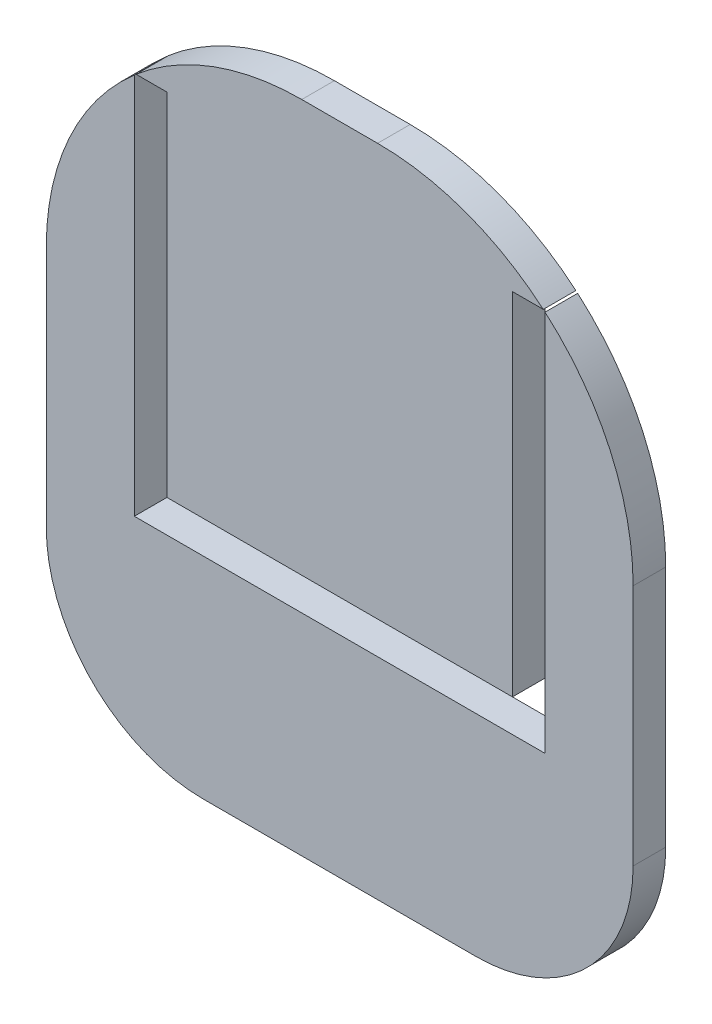
ISO-10303-21;
HEADER;
FILE_DESCRIPTION(('STEP AP214'),'2;1');
FILE_NAME('part.step','',(''),(''),'','','');
FILE_SCHEMA(('AUTOMOTIVE_DESIGN { 1 0 10303 214 1 1 1 1 }'));
ENDSEC;
DATA;
#1=APPLICATION_CONTEXT('core data for automotive mechanical design processes');
#2=APPLICATION_PROTOCOL_DEFINITION('international standard','automotive_design',2000,#1);
#3=PRODUCT_CONTEXT('',#1,'mechanical');
#4=PRODUCT('Part','Part','',(#3));
#5=PRODUCT_RELATED_PRODUCT_CATEGORY('part','',(#4));
#6=PRODUCT_DEFINITION_FORMATION('','',#4);
#7=PRODUCT_DEFINITION_CONTEXT('part definition',#1,'design');
#8=PRODUCT_DEFINITION('design','',#6,#7);
#9=PRODUCT_DEFINITION_SHAPE('','',#8);
#10=(LENGTH_UNIT() NAMED_UNIT(*) SI_UNIT(.MILLI.,.METRE.));
#11=(NAMED_UNIT(*) PLANE_ANGLE_UNIT() SI_UNIT($,.RADIAN.));
#12=(NAMED_UNIT(*) SI_UNIT($,.STERADIAN.) SOLID_ANGLE_UNIT());
#13=UNCERTAINTY_MEASURE_WITH_UNIT(LENGTH_MEASURE(1.E-05),#10,'distance_accuracy_value','');
#14=(GEOMETRIC_REPRESENTATION_CONTEXT(3) GLOBAL_UNCERTAINTY_ASSIGNED_CONTEXT((#13)) GLOBAL_UNIT_ASSIGNED_CONTEXT((#10,
#11,#12)) REPRESENTATION_CONTEXT('',''));
#15=CARTESIAN_POINT('',(0.,0.,0.));
#16=DIRECTION('',(0.,0.,1.));
#17=DIRECTION('',(1.,0.,0.));
#18=AXIS2_PLACEMENT_3D('',#15,#16,#17);
#19=CARTESIAN_POINT('',(5.,-29.5,4.3));
#20=DIRECTION('',(0.,0.,-1.));
#21=DIRECTION('',(-1.,0.,0.));
#22=AXIS2_PLACEMENT_3D('',#19,#20,#21);
#23=CYLINDRICAL_SURFACE('',#22,33.7);
#24=CARTESIAN_POINT('',(5.,-29.5,4.3));
#25=DIRECTION('',(0.,0.,1.));
#26=DIRECTION('',(-1.,0.,0.));
#27=AXIS2_PLACEMENT_3D('',#24,#25,#26);
#28=CIRCLE('',#27,33.7);
#29=CARTESIAN_POINT('',(26.85235312187,-3.84527990725494,4.3));
#30=VERTEX_POINT('',#29);
#31=CARTESIAN_POINT('',(5.,4.2,4.3));
#32=VERTEX_POINT('',#31);
#33=EDGE_CURVE('E142',#30,#32,#28,.T.);
#34=ORIENTED_EDGE('',*,*,#33,.F.);
#35=DIRECTION('',(0.,0.,-1.));
#36=VECTOR('',#35,1.);
#37=CARTESIAN_POINT('',(26.85235312187,-3.84527990725494,4.3));
#38=LINE('',#37,#36);
#39=CARTESIAN_POINT('',(26.85235312187,-3.84527990725494,0.));
#40=VERTEX_POINT('',#39);
#41=EDGE_CURVE('E65',#30,#40,#38,.T.);
#42=ORIENTED_EDGE('',*,*,#41,.T.);
#43=CARTESIAN_POINT('',(5.,-29.5,0.));
#44=DIRECTION('',(0.,0.,1.));
#45=DIRECTION('',(-1.,0.,0.));
#46=AXIS2_PLACEMENT_3D('',#43,#44,#45);
#47=CIRCLE('',#46,33.7);
#48=CARTESIAN_POINT('',(5.,4.2,0.));
#49=VERTEX_POINT('',#48);
#50=EDGE_CURVE('E51',#40,#49,#47,.T.);
#51=ORIENTED_EDGE('',*,*,#50,.T.);
#52=DIRECTION('',(0.,0.,-1.));
#53=VECTOR('',#52,1.);
#54=CARTESIAN_POINT('',(5.,4.2,4.3));
#55=LINE('',#54,#53);
#56=EDGE_CURVE('E146',#32,#49,#55,.T.);
#57=ORIENTED_EDGE('',*,*,#56,.F.);
#58=EDGE_LOOP('',(#34,#42,#51,#57));
#59=FACE_BOUND('',#58,.T.);
#60=ADVANCED_FACE('F48',(#59),#23,.T.);
#61=CARTESIAN_POINT('',(-18.,-61.5,4.3));
#62=DIRECTION('',(0.,0.,1.));
#63=DIRECTION('',(1.,0.,0.));
#64=AXIS2_PLACEMENT_3D('',#61,#62,#63);
#65=PLANE('',#64);
#66=DIRECTION('',(-1.,0.,0.));
#67=VECTOR('',#66,1.);
#68=CARTESIAN_POINT('',(-27.085,-3.84527990725494,4.3));
#69=LINE('',#68,#67);
#70=CARTESIAN_POINT('',(-22.785,-3.84527990725494,4.3));
#71=VERTEX_POINT('',#70);
#72=CARTESIAN_POINT('',(-26.85235312187,-3.84527990725494,4.3));
#73=VERTEX_POINT('',#72);
#74=EDGE_CURVE('E174',#71,#73,#69,.T.);
#75=ORIENTED_EDGE('',*,*,#74,.F.);
#76=DIRECTION('',(0.,1.,0.));
#77=VECTOR('',#76,1.);
#78=CARTESIAN_POINT('',(-22.785,-3.84527990725494,4.3));
#79=LINE('',#78,#77);
#80=CARTESIAN_POINT('',(-22.785,-50.1452799072549,4.3));
#81=VERTEX_POINT('',#80);
#82=EDGE_CURVE('E171',#81,#71,#79,.T.);
#83=ORIENTED_EDGE('',*,*,#82,.F.);
#84=DIRECTION('',(-1.,0.,0.));
#85=VECTOR('',#84,1.);
#86=CARTESIAN_POINT('',(-22.785,-50.1452799072549,4.3));
#87=LINE('',#86,#85);
#88=CARTESIAN_POINT('',(22.785,-50.1452799072549,4.3));
#89=VERTEX_POINT('',#88);
#90=EDGE_CURVE('E126',#89,#81,#87,.T.);
#91=ORIENTED_EDGE('',*,*,#90,.F.);
#92=DIRECTION('',(0.,-1.,0.));
#93=VECTOR('',#92,1.);
#94=CARTESIAN_POINT('',(22.785,-50.1452799072549,4.3));
#95=LINE('',#94,#93);
#96=CARTESIAN_POINT('',(22.785,-3.84527990725494,4.3));
#97=VERTEX_POINT('',#96);
#98=EDGE_CURVE('E57',#97,#89,#95,.T.);
#99=ORIENTED_EDGE('',*,*,#98,.F.);
#100=DIRECTION('',(-1.,0.,0.));
#101=VECTOR('',#100,1.);
#102=CARTESIAN_POINT('',(22.785,-3.84527990725494,4.3));
#103=LINE('',#102,#101);
#104=EDGE_CURVE('E12',#30,#97,#103,.T.);
#105=ORIENTED_EDGE('',*,*,#104,.F.);
#106=ORIENTED_EDGE('',*,*,#33,.T.);
#107=DIRECTION('',(-1.,0.,0.));
#108=VECTOR('',#107,1.);
#109=CARTESIAN_POINT('',(-4.99999999999999,4.2,4.3));
#110=LINE('',#109,#108);
#111=CARTESIAN_POINT('',(-4.99999999999999,4.2,4.3));
#112=VERTEX_POINT('',#111);
#113=EDGE_CURVE('E141',#32,#112,#110,.T.);
#114=ORIENTED_EDGE('',*,*,#113,.T.);
#115=CARTESIAN_POINT('',(-4.99999999999999,-29.5,4.3));
#116=DIRECTION('',(0.,0.,1.));
#117=DIRECTION('',(-1.,0.,0.));
#118=AXIS2_PLACEMENT_3D('',#115,#116,#117);
#119=CIRCLE('',#118,33.7);
#120=EDGE_CURVE('E138',#112,#73,#119,.T.);
#121=ORIENTED_EDGE('',*,*,#120,.T.);
#122=EDGE_LOOP('',(#75,#83,#91,#99,#105,#106,#114,#121));
#123=FACE_BOUND('',#122,.T.);
#124=ADVANCED_FACE('F132',(#123),#65,.T.);
#125=CARTESIAN_POINT('',(-18.,-61.5,0.));
#126=DIRECTION('',(0.,0.,1.));
#127=DIRECTION('',(1.,0.,0.));
#128=AXIS2_PLACEMENT_3D('',#125,#126,#127);
#129=PLANE('',#128);
#130=DIRECTION('',(0.,1.,0.));
#131=VECTOR('',#130,1.);
#132=CARTESIAN_POINT('',(-22.785,-61.5,0.));
#133=LINE('',#132,#131);
#134=CARTESIAN_POINT('',(-22.785,-50.1452799072549,0.));
#135=VERTEX_POINT('',#134);
#136=CARTESIAN_POINT('',(-22.785,-3.84527990725494,0.));
#137=VERTEX_POINT('',#136);
#138=EDGE_CURVE('E94',#135,#137,#133,.T.);
#139=ORIENTED_EDGE('',*,*,#138,.T.);
#140=DIRECTION('',(-1.,0.,0.));
#141=VECTOR('',#140,1.);
#142=CARTESIAN_POINT('',(-18.,-3.84527990725494,0.));
#143=LINE('',#142,#141);
#144=CARTESIAN_POINT('',(-26.85235312187,-3.84527990725494,0.));
#145=VERTEX_POINT('',#144);
#146=EDGE_CURVE('E187',#137,#145,#143,.T.);
#147=ORIENTED_EDGE('',*,*,#146,.T.);
#148=CARTESIAN_POINT('',(-4.99999999999999,-29.5,0.));
#149=DIRECTION('',(0.,0.,1.));
#150=DIRECTION('',(-1.,0.,0.));
#151=AXIS2_PLACEMENT_3D('',#148,#149,#150);
#152=CIRCLE('',#151,33.7);
#153=CARTESIAN_POINT('',(-4.99999999999999,4.2,0.));
#154=VERTEX_POINT('',#153);
#155=EDGE_CURVE('E143',#154,#145,#152,.T.);
#156=ORIENTED_EDGE('',*,*,#155,.F.);
#157=DIRECTION('',(-1.,0.,0.));
#158=VECTOR('',#157,1.);
#159=CARTESIAN_POINT('',(-4.99999999999999,4.2,0.));
#160=LINE('',#159,#158);
#161=EDGE_CURVE('E154',#49,#154,#160,.T.);
#162=ORIENTED_EDGE('',*,*,#161,.F.);
#163=ORIENTED_EDGE('',*,*,#50,.F.);
#164=DIRECTION('',(-1.,0.,0.));
#165=VECTOR('',#164,1.);
#166=CARTESIAN_POINT('',(-18.,-3.84527990725494,0.));
#167=LINE('',#166,#165);
#168=CARTESIAN_POINT('',(22.785,-3.84527990725494,0.));
#169=VERTEX_POINT('',#168);
#170=EDGE_CURVE('E164',#40,#169,#167,.T.);
#171=ORIENTED_EDGE('',*,*,#170,.T.);
#172=DIRECTION('',(0.,-1.,0.));
#173=VECTOR('',#172,1.);
#174=CARTESIAN_POINT('',(22.785,-61.5,0.));
#175=LINE('',#174,#173);
#176=CARTESIAN_POINT('',(22.785,-50.1452799072549,0.));
#177=VERTEX_POINT('',#176);
#178=EDGE_CURVE('E124',#169,#177,#175,.T.);
#179=ORIENTED_EDGE('',*,*,#178,.T.);
#180=DIRECTION('',(-1.,0.,0.));
#181=VECTOR('',#180,1.);
#182=CARTESIAN_POINT('',(-18.,-50.1452799072549,0.));
#183=LINE('',#182,#181);
#184=EDGE_CURVE('E160',#177,#135,#183,.T.);
#185=ORIENTED_EDGE('',*,*,#184,.T.);
#186=EDGE_LOOP('',(#139,#147,#156,#162,#163,#171,#179,#185));
#187=FACE_BOUND('',#186,.T.);
#188=ADVANCED_FACE('F185',(#187),#129,.F.);
#189=CARTESIAN_POINT('',(-4.99999999999999,4.2,4.3));
#190=DIRECTION('',(0.,-1.,0.));
#191=DIRECTION('',(1.,0.,0.));
#192=AXIS2_PLACEMENT_3D('',#189,#190,#191);
#193=PLANE('',#192);
#194=ORIENTED_EDGE('',*,*,#161,.T.);
#195=DIRECTION('',(0.,0.,-1.));
#196=VECTOR('',#195,1.);
#197=CARTESIAN_POINT('',(-4.99999999999999,4.2,4.3));
#198=LINE('',#197,#196);
#199=EDGE_CURVE('E151',#112,#154,#198,.T.);
#200=ORIENTED_EDGE('',*,*,#199,.F.);
#201=ORIENTED_EDGE('',*,*,#113,.F.);
#202=ORIENTED_EDGE('',*,*,#56,.T.);
#203=EDGE_LOOP('',(#194,#200,#201,#202));
#204=FACE_BOUND('',#203,.T.);
#205=ADVANCED_FACE('F193',(#204),#193,.F.);
#206=CARTESIAN_POINT('',(-4.99999999999999,-29.5,4.3));
#207=DIRECTION('',(0.,0.,-1.));
#208=DIRECTION('',(-1.,0.,0.));
#209=AXIS2_PLACEMENT_3D('',#206,#207,#208);
#210=CYLINDRICAL_SURFACE('',#209,33.7);
#211=ORIENTED_EDGE('',*,*,#155,.T.);
#212=DIRECTION('',(0.,0.,-1.));
#213=VECTOR('',#212,1.);
#214=CARTESIAN_POINT('',(-26.85235312187,-3.84527990725494,4.3));
#215=LINE('',#214,#213);
#216=EDGE_CURVE('E145',#145,#73,#215,.F.);
#217=ORIENTED_EDGE('',*,*,#216,.T.);
#218=ORIENTED_EDGE('',*,*,#120,.F.);
#219=ORIENTED_EDGE('',*,*,#199,.T.);
#220=EDGE_LOOP('',(#211,#217,#218,#219));
#221=FACE_BOUND('',#220,.T.);
#222=ADVANCED_FACE('F182',(#221),#210,.T.);
#223=CARTESIAN_POINT('',(-27.085,-3.84527990725494,-5.7));
#224=DIRECTION('',(0.,1.,0.));
#225=DIRECTION('',(0.,0.,1.));
#226=AXIS2_PLACEMENT_3D('',#223,#224,#225);
#227=PLANE('',#226);
#228=ORIENTED_EDGE('',*,*,#146,.F.);
#229=DIRECTION('',(0.,0.,1.));
#230=VECTOR('',#229,1.);
#231=CARTESIAN_POINT('',(-22.785,-3.84527990725494,-5.7));
#232=LINE('',#231,#230);
#233=EDGE_CURVE('E166',#137,#71,#232,.T.);
#234=ORIENTED_EDGE('',*,*,#233,.T.);
#235=ORIENTED_EDGE('',*,*,#74,.T.);
#236=ORIENTED_EDGE('',*,*,#216,.F.);
#237=EDGE_LOOP('',(#228,#234,#235,#236));
#238=FACE_BOUND('',#237,.T.);
#239=ADVANCED_FACE('F180',(#238),#227,.F.);
#240=CARTESIAN_POINT('',(-22.785,-3.84527990725494,-5.7));
#241=DIRECTION('',(1.,0.,0.));
#242=DIRECTION('',(0.,1.,0.));
#243=AXIS2_PLACEMENT_3D('',#240,#241,#242);
#244=PLANE('',#243);
#245=DIRECTION('',(0.,0.,1.));
#246=VECTOR('',#245,1.);
#247=CARTESIAN_POINT('',(-22.785,-50.1452799072549,-5.7));
#248=LINE('',#247,#246);
#249=EDGE_CURVE('E172',#135,#81,#248,.T.);
#250=ORIENTED_EDGE('',*,*,#249,.T.);
#251=ORIENTED_EDGE('',*,*,#82,.T.);
#252=ORIENTED_EDGE('',*,*,#233,.F.);
#253=ORIENTED_EDGE('',*,*,#138,.F.);
#254=EDGE_LOOP('',(#250,#251,#252,#253));
#255=FACE_BOUND('',#254,.T.);
#256=ADVANCED_FACE('F177',(#255),#244,.F.);
#257=CARTESIAN_POINT('',(-22.785,-50.1452799072549,-5.7));
#258=DIRECTION('',(0.,1.,0.));
#259=DIRECTION('',(0.,0.,1.));
#260=AXIS2_PLACEMENT_3D('',#257,#258,#259);
#261=PLANE('',#260);
#262=DIRECTION('',(0.,0.,1.));
#263=VECTOR('',#262,1.);
#264=CARTESIAN_POINT('',(22.785,-50.1452799072549,-5.7));
#265=LINE('',#264,#263);
#266=EDGE_CURVE('E87',#177,#89,#265,.T.);
#267=ORIENTED_EDGE('',*,*,#266,.T.);
#268=ORIENTED_EDGE('',*,*,#90,.T.);
#269=ORIENTED_EDGE('',*,*,#249,.F.);
#270=ORIENTED_EDGE('',*,*,#184,.F.);
#271=EDGE_LOOP('',(#267,#268,#269,#270));
#272=FACE_BOUND('',#271,.T.);
#273=ADVANCED_FACE('F214',(#272),#261,.F.);
#274=CARTESIAN_POINT('',(22.785,-50.1452799072549,-5.7));
#275=DIRECTION('',(-1.,0.,0.));
#276=DIRECTION('',(0.,-1.,0.));
#277=AXIS2_PLACEMENT_3D('',#274,#275,#276);
#278=PLANE('',#277);
#279=DIRECTION('',(0.,0.,1.));
#280=VECTOR('',#279,1.);
#281=CARTESIAN_POINT('',(22.785,-3.84527990725494,-5.7));
#282=LINE('',#281,#280);
#283=EDGE_CURVE('E117',#169,#97,#282,.T.);
#284=ORIENTED_EDGE('',*,*,#283,.T.);
#285=ORIENTED_EDGE('',*,*,#98,.T.);
#286=ORIENTED_EDGE('',*,*,#266,.F.);
#287=ORIENTED_EDGE('',*,*,#178,.F.);
#288=EDGE_LOOP('',(#284,#285,#286,#287));
#289=FACE_BOUND('',#288,.T.);
#290=ADVANCED_FACE('F120',(#289),#278,.F.);
#291=CARTESIAN_POINT('',(22.785,-3.84527990725494,-5.7));
#292=DIRECTION('',(0.,1.,0.));
#293=DIRECTION('',(0.,0.,1.));
#294=AXIS2_PLACEMENT_3D('',#291,#292,#293);
#295=PLANE('',#294);
#296=ORIENTED_EDGE('',*,*,#104,.T.);
#297=ORIENTED_EDGE('',*,*,#283,.F.);
#298=ORIENTED_EDGE('',*,*,#170,.F.);
#299=ORIENTED_EDGE('',*,*,#41,.F.);
#300=EDGE_LOOP('',(#296,#297,#298,#299));
#301=FACE_BOUND('',#300,.T.);
#302=ADVANCED_FACE('F128',(#301),#295,.F.);
#303=CLOSED_SHELL('',(#60,#124,#188,#205,#222,#239,#256,#273,#290,#302));
#304=MANIFOLD_SOLID_BREP('B2',#303);
#305=CARTESIAN_POINT('',(-38.7,-29.5,4.3));
#306=DIRECTION('',(1.,0.,0.));
#307=DIRECTION('',(0.,0.,-1.));
#308=AXIS2_PLACEMENT_3D('',#305,#306,#307);
#309=PLANE('',#308);
#310=DIRECTION('',(0.,-1.,0.));
#311=VECTOR('',#310,1.);
#312=CARTESIAN_POINT('',(-38.7,-29.5,0.));
#313=LINE('',#312,#311);
#314=CARTESIAN_POINT('',(-38.7,-29.5,0.));
#315=VERTEX_POINT('',#314);
#316=CARTESIAN_POINT('',(-38.7,-61.5,0.));
#317=VERTEX_POINT('',#316);
#318=EDGE_CURVE('E326',#315,#317,#313,.T.);
#319=ORIENTED_EDGE('',*,*,#318,.T.);
#320=DIRECTION('',(0.,0.,-1.));
#321=VECTOR('',#320,1.);
#322=CARTESIAN_POINT('',(-38.7,-61.5,4.3));
#323=LINE('',#322,#321);
#324=CARTESIAN_POINT('',(-38.7,-61.5,4.3));
#325=VERTEX_POINT('',#324);
#326=EDGE_CURVE('E380',#325,#317,#323,.T.);
#327=ORIENTED_EDGE('',*,*,#326,.F.);
#328=DIRECTION('',(0.,-1.,0.));
#329=VECTOR('',#328,1.);
#330=CARTESIAN_POINT('',(-38.7,-29.5,4.3));
#331=LINE('',#330,#329);
#332=CARTESIAN_POINT('',(-38.7,-29.5,4.3));
#333=VERTEX_POINT('',#332);
#334=EDGE_CURVE('E299',#333,#325,#331,.T.);
#335=ORIENTED_EDGE('',*,*,#334,.F.);
#336=DIRECTION('',(0.,0.,-1.));
#337=VECTOR('',#336,1.);
#338=CARTESIAN_POINT('',(-38.7,-29.5,4.3));
#339=LINE('',#338,#337);
#340=EDGE_CURVE('E368',#333,#315,#339,.T.);
#341=ORIENTED_EDGE('',*,*,#340,.T.);
#342=EDGE_LOOP('',(#319,#327,#335,#341));
#343=FACE_BOUND('',#342,.T.);
#344=ADVANCED_FACE('F275',(#343),#309,.F.);
#345=CARTESIAN_POINT('',(-18.,-61.5,4.3));
#346=DIRECTION('',(0.,0.,-1.));
#347=DIRECTION('',(-1.,0.,0.));
#348=AXIS2_PLACEMENT_3D('',#345,#346,#347);
#349=CYLINDRICAL_SURFACE('',#348,20.7);
#350=CARTESIAN_POINT('',(-18.,-61.5,0.));
#351=DIRECTION('',(0.,0.,1.));
#352=DIRECTION('',(1.,0.,0.));
#353=AXIS2_PLACEMENT_3D('',#350,#351,#352);
#354=CIRCLE('',#353,20.7);
#355=CARTESIAN_POINT('',(-18.,-82.2,0.));
#356=VERTEX_POINT('',#355);
#357=EDGE_CURVE('E381',#317,#356,#354,.T.);
#358=ORIENTED_EDGE('',*,*,#357,.T.);
#359=DIRECTION('',(0.,0.,-1.));
#360=VECTOR('',#359,1.);
#361=CARTESIAN_POINT('',(-18.,-82.2,4.3));
#362=LINE('',#361,#360);
#363=CARTESIAN_POINT('',(-18.,-82.2,4.3));
#364=VERTEX_POINT('',#363);
#365=EDGE_CURVE('E402',#364,#356,#362,.T.);
#366=ORIENTED_EDGE('',*,*,#365,.F.);
#367=CARTESIAN_POINT('',(-18.,-61.5,4.3));
#368=DIRECTION('',(0.,0.,1.));
#369=DIRECTION('',(1.,0.,0.));
#370=AXIS2_PLACEMENT_3D('',#367,#368,#369);
#371=CIRCLE('',#370,20.7);
#372=EDGE_CURVE('E395',#325,#364,#371,.T.);
#373=ORIENTED_EDGE('',*,*,#372,.F.);
#374=ORIENTED_EDGE('',*,*,#326,.T.);
#375=EDGE_LOOP('',(#358,#366,#373,#374));
#376=FACE_BOUND('',#375,.T.);
#377=ADVANCED_FACE('F277',(#376),#349,.T.);
#378=CARTESIAN_POINT('',(0.500000000000015,-82.2,4.3));
#379=DIRECTION('',(0.,1.,0.));
#380=DIRECTION('',(0.,0.,1.));
#381=AXIS2_PLACEMENT_3D('',#378,#379,#380);
#382=PLANE('',#381);
#383=DIRECTION('',(1.,0.,0.));
#384=VECTOR('',#383,1.);
#385=CARTESIAN_POINT('',(0.500000000000015,-82.2,0.));
#386=LINE('',#385,#384);
#387=CARTESIAN_POINT('',(18.,-82.2,0.));
#388=VERTEX_POINT('',#387);
#389=EDGE_CURVE('E384',#356,#388,#386,.T.);
#390=ORIENTED_EDGE('',*,*,#389,.T.);
#391=DIRECTION('',(0.,0.,-1.));
#392=VECTOR('',#391,1.);
#393=CARTESIAN_POINT('',(18.,-82.2,4.3));
#394=LINE('',#393,#392);
#395=CARTESIAN_POINT('',(18.,-82.2,4.3));
#396=VERTEX_POINT('',#395);
#397=EDGE_CURVE('E399',#396,#388,#394,.T.);
#398=ORIENTED_EDGE('',*,*,#397,.F.);
#399=DIRECTION('',(1.,0.,0.));
#400=VECTOR('',#399,1.);
#401=CARTESIAN_POINT('',(-18.,-82.2,4.3));
#402=LINE('',#401,#400);
#403=EDGE_CURVE('E335',#364,#396,#402,.T.);
#404=ORIENTED_EDGE('',*,*,#403,.F.);
#405=ORIENTED_EDGE('',*,*,#365,.T.);
#406=EDGE_LOOP('',(#390,#398,#404,#405));
#407=FACE_BOUND('',#406,.T.);
#408=ADVANCED_FACE('F428',(#407),#382,.F.);
#409=CARTESIAN_POINT('',(18.,-61.5,4.3));
#410=DIRECTION('',(0.,0.,-1.));
#411=DIRECTION('',(-1.,0.,0.));
#412=AXIS2_PLACEMENT_3D('',#409,#410,#411);
#413=CYLINDRICAL_SURFACE('',#412,20.7);
#414=CARTESIAN_POINT('',(18.,-61.5,0.));
#415=DIRECTION('',(0.,0.,1.));
#416=DIRECTION('',(1.,0.,0.));
#417=AXIS2_PLACEMENT_3D('',#414,#415,#416);
#418=CIRCLE('',#417,20.7);
#419=CARTESIAN_POINT('',(38.7,-61.5,0.));
#420=VERTEX_POINT('',#419);
#421=EDGE_CURVE('E387',#388,#420,#418,.T.);
#422=ORIENTED_EDGE('',*,*,#421,.T.);
#423=DIRECTION('',(0.,0.,-1.));
#424=VECTOR('',#423,1.);
#425=CARTESIAN_POINT('',(38.7,-61.5,4.3));
#426=LINE('',#425,#424);
#427=CARTESIAN_POINT('',(38.7,-61.5,4.3));
#428=VERTEX_POINT('',#427);
#429=EDGE_CURVE('E367',#428,#420,#426,.T.);
#430=ORIENTED_EDGE('',*,*,#429,.F.);
#431=CARTESIAN_POINT('',(18.,-61.5,4.3));
#432=DIRECTION('',(0.,0.,1.));
#433=DIRECTION('',(1.,0.,0.));
#434=AXIS2_PLACEMENT_3D('',#431,#432,#433);
#435=CIRCLE('',#434,20.7);
#436=EDGE_CURVE('E354',#396,#428,#435,.T.);
#437=ORIENTED_EDGE('',*,*,#436,.F.);
#438=ORIENTED_EDGE('',*,*,#397,.T.);
#439=EDGE_LOOP('',(#422,#430,#437,#438));
#440=FACE_BOUND('',#439,.T.);
#441=ADVANCED_FACE('F431',(#440),#413,.T.);
#442=CARTESIAN_POINT('',(38.7,-29.5,4.3));
#443=DIRECTION('',(-1.,0.,0.));
#444=DIRECTION('',(0.,0.,1.));
#445=AXIS2_PLACEMENT_3D('',#442,#443,#444);
#446=PLANE('',#445);
#447=DIRECTION('',(0.,1.,0.));
#448=VECTOR('',#447,1.);
#449=CARTESIAN_POINT('',(38.7,-29.5,0.));
#450=LINE('',#449,#448);
#451=CARTESIAN_POINT('',(38.7,-29.5,0.));
#452=VERTEX_POINT('',#451);
#453=EDGE_CURVE('E363',#420,#452,#450,.T.);
#454=ORIENTED_EDGE('',*,*,#453,.T.);
#455=DIRECTION('',(0.,0.,-1.));
#456=VECTOR('',#455,1.);
#457=CARTESIAN_POINT('',(38.7,-29.5,4.3));
#458=LINE('',#457,#456);
#459=CARTESIAN_POINT('',(38.7,-29.5,4.3));
#460=VERTEX_POINT('',#459);
#461=EDGE_CURVE('E360',#460,#452,#458,.T.);
#462=ORIENTED_EDGE('',*,*,#461,.F.);
#463=DIRECTION('',(0.,1.,0.));
#464=VECTOR('',#463,1.);
#465=CARTESIAN_POINT('',(38.7,-29.5,4.3));
#466=LINE('',#465,#464);
#467=EDGE_CURVE('E345',#428,#460,#466,.T.);
#468=ORIENTED_EDGE('',*,*,#467,.F.);
#469=ORIENTED_EDGE('',*,*,#429,.T.);
#470=EDGE_LOOP('',(#454,#462,#468,#469));
#471=FACE_BOUND('',#470,.T.);
#472=ADVANCED_FACE('F361',(#471),#446,.F.);
#473=CARTESIAN_POINT('',(-18.,-61.5,0.));
#474=DIRECTION('',(0.,0.,1.));
#475=DIRECTION('',(1.,0.,0.));
#476=AXIS2_PLACEMENT_3D('',#473,#474,#475);
#477=PLANE('',#476);
#478=CARTESIAN_POINT('',(-4.99999999999999,-29.5,0.));
#479=DIRECTION('',(0.,0.,1.));
#480=DIRECTION('',(-1.,0.,0.));
#481=AXIS2_PLACEMENT_3D('',#478,#479,#480);
#482=CIRCLE('',#481,33.7);
#483=CARTESIAN_POINT('',(-27.085,-4.04527990725494,0.));
#484=VERTEX_POINT('',#483);
#485=EDGE_CURVE('E392',#484,#315,#482,.T.);
#486=ORIENTED_EDGE('',*,*,#485,.F.);
#487=DIRECTION('',(0.,-1.,0.));
#488=VECTOR('',#487,1.);
#489=CARTESIAN_POINT('',(-27.085,-61.5,0.));
#490=LINE('',#489,#488);
#491=CARTESIAN_POINT('',(-27.085,-54.4452799072549,0.));
#492=VERTEX_POINT('',#491);
#493=EDGE_CURVE('E46',#484,#492,#490,.T.);
#494=ORIENTED_EDGE('',*,*,#493,.T.);
#495=DIRECTION('',(1.,0.,0.));
#496=VECTOR('',#495,1.);
#497=CARTESIAN_POINT('',(-18.,-54.4452799072549,0.));
#498=LINE('',#497,#496);
#499=CARTESIAN_POINT('',(27.085,-54.4452799072549,0.));
#500=VERTEX_POINT('',#499);
#501=EDGE_CURVE('E404',#492,#500,#498,.T.);
#502=ORIENTED_EDGE('',*,*,#501,.T.);
#503=DIRECTION('',(0.,1.,0.));
#504=VECTOR('',#503,1.);
#505=CARTESIAN_POINT('',(27.085,-61.5,0.));
#506=LINE('',#505,#504);
#507=CARTESIAN_POINT('',(27.085,-4.04527990725493,0.));
#508=VERTEX_POINT('',#507);
#509=EDGE_CURVE('E283',#500,#508,#506,.T.);
#510=ORIENTED_EDGE('',*,*,#509,.T.);
#511=CARTESIAN_POINT('',(5.,-29.5,0.));
#512=DIRECTION('',(0.,0.,1.));
#513=DIRECTION('',(-1.,0.,0.));
#514=AXIS2_PLACEMENT_3D('',#511,#512,#513);
#515=CIRCLE('',#514,33.7);
#516=EDGE_CURVE('E390',#452,#508,#515,.T.);
#517=ORIENTED_EDGE('',*,*,#516,.F.);
#518=ORIENTED_EDGE('',*,*,#453,.F.);
#519=ORIENTED_EDGE('',*,*,#421,.F.);
#520=ORIENTED_EDGE('',*,*,#389,.F.);
#521=ORIENTED_EDGE('',*,*,#357,.F.);
#522=ORIENTED_EDGE('',*,*,#318,.F.);
#523=EDGE_LOOP('',(#486,#494,#502,#510,#517,#518,#519,#520,#521,#522));
#524=FACE_BOUND('',#523,.T.);
#525=ADVANCED_FACE('F410',(#524),#477,.F.);
#526=CARTESIAN_POINT('',(-18.,-61.5,4.3));
#527=DIRECTION('',(0.,0.,1.));
#528=DIRECTION('',(1.,0.,0.));
#529=AXIS2_PLACEMENT_3D('',#526,#527,#528);
#530=PLANE('',#529);
#531=DIRECTION('',(0.,-1.,0.));
#532=VECTOR('',#531,1.);
#533=CARTESIAN_POINT('',(-27.085,-4.04527990725494,4.3));
#534=LINE('',#533,#532);
#535=CARTESIAN_POINT('',(-27.085,-4.04527990725494,4.3));
#536=VERTEX_POINT('',#535);
#537=CARTESIAN_POINT('',(-27.085,-54.4452799072549,4.3));
#538=VERTEX_POINT('',#537);
#539=EDGE_CURVE('E446',#536,#538,#534,.T.);
#540=ORIENTED_EDGE('',*,*,#539,.F.);
#541=CARTESIAN_POINT('',(-4.99999999999999,-29.5,4.3));
#542=DIRECTION('',(0.,0.,1.));
#543=DIRECTION('',(-1.,0.,0.));
#544=AXIS2_PLACEMENT_3D('',#541,#542,#543);
#545=CIRCLE('',#544,33.7);
#546=EDGE_CURVE('E374',#536,#333,#545,.T.);
#547=ORIENTED_EDGE('',*,*,#546,.T.);
#548=ORIENTED_EDGE('',*,*,#334,.T.);
#549=ORIENTED_EDGE('',*,*,#372,.T.);
#550=ORIENTED_EDGE('',*,*,#403,.T.);
#551=ORIENTED_EDGE('',*,*,#436,.T.);
#552=ORIENTED_EDGE('',*,*,#467,.T.);
#553=CARTESIAN_POINT('',(5.,-29.5,4.3));
#554=DIRECTION('',(0.,0.,1.));
#555=DIRECTION('',(-1.,0.,0.));
#556=AXIS2_PLACEMENT_3D('',#553,#554,#555);
#557=CIRCLE('',#556,33.7);
#558=CARTESIAN_POINT('',(27.085,-4.04527990725493,4.3));
#559=VERTEX_POINT('',#558);
#560=EDGE_CURVE('E352',#460,#559,#557,.T.);
#561=ORIENTED_EDGE('',*,*,#560,.T.);
#562=DIRECTION('',(0.,1.,0.));
#563=VECTOR('',#562,1.);
#564=CARTESIAN_POINT('',(27.085,-3.84527990725494,4.3));
#565=LINE('',#564,#563);
#566=CARTESIAN_POINT('',(27.085,-54.4452799072549,4.3));
#567=VERTEX_POINT('',#566);
#568=EDGE_CURVE('E417',#567,#559,#565,.T.);
#569=ORIENTED_EDGE('',*,*,#568,.F.);
#570=DIRECTION('',(1.,0.,0.));
#571=VECTOR('',#570,1.);
#572=CARTESIAN_POINT('',(-27.085,-54.4452799072549,4.3));
#573=LINE('',#572,#571);
#574=EDGE_CURVE('E449',#538,#567,#573,.T.);
#575=ORIENTED_EDGE('',*,*,#574,.F.);
#576=EDGE_LOOP('',(#540,#547,#548,#549,#550,#551,#552,#561,#569,#575));
#577=FACE_BOUND('',#576,.T.);
#578=ADVANCED_FACE('F348',(#577),#530,.T.);
#579=CARTESIAN_POINT('',(-4.99999999999999,-29.5,4.3));
#580=DIRECTION('',(0.,0.,-1.));
#581=DIRECTION('',(-1.,0.,0.));
#582=AXIS2_PLACEMENT_3D('',#579,#580,#581);
#583=CYLINDRICAL_SURFACE('',#582,33.7);
#584=ORIENTED_EDGE('',*,*,#546,.F.);
#585=DIRECTION('',(0.,0.,-1.));
#586=VECTOR('',#585,1.);
#587=CARTESIAN_POINT('',(-27.085,-4.04527990725494,4.3));
#588=LINE('',#587,#586);
#589=EDGE_CURVE('E385',#536,#484,#588,.T.);
#590=ORIENTED_EDGE('',*,*,#589,.T.);
#591=ORIENTED_EDGE('',*,*,#485,.T.);
#592=ORIENTED_EDGE('',*,*,#340,.F.);
#593=EDGE_LOOP('',(#584,#590,#591,#592));
#594=FACE_BOUND('',#593,.T.);
#595=ADVANCED_FACE('F439',(#594),#583,.T.);
#596=CARTESIAN_POINT('',(5.,-29.5,4.3));
#597=DIRECTION('',(0.,0.,-1.));
#598=DIRECTION('',(-1.,0.,0.));
#599=AXIS2_PLACEMENT_3D('',#596,#597,#598);
#600=CYLINDRICAL_SURFACE('',#599,33.7);
#601=ORIENTED_EDGE('',*,*,#516,.T.);
#602=DIRECTION('',(0.,0.,-1.));
#603=VECTOR('',#602,1.);
#604=CARTESIAN_POINT('',(27.085,-4.04527990725493,4.3));
#605=LINE('',#604,#603);
#606=EDGE_CURVE('E373',#508,#559,#605,.F.);
#607=ORIENTED_EDGE('',*,*,#606,.T.);
#608=ORIENTED_EDGE('',*,*,#560,.F.);
#609=ORIENTED_EDGE('',*,*,#461,.T.);
#610=EDGE_LOOP('',(#601,#607,#608,#609));
#611=FACE_BOUND('',#610,.T.);
#612=ADVANCED_FACE('F371',(#611),#600,.T.);
#613=CARTESIAN_POINT('',(-27.085,-54.4452799072549,-5.7));
#614=DIRECTION('',(0.,-1.,0.));
#615=DIRECTION('',(0.,0.,-1.));
#616=AXIS2_PLACEMENT_3D('',#613,#614,#615);
#617=PLANE('',#616);
#618=DIRECTION('',(0.,0.,1.));
#619=VECTOR('',#618,1.);
#620=CARTESIAN_POINT('',(-27.085,-54.4452799072549,-5.7));
#621=LINE('',#620,#619);
#622=EDGE_CURVE('E421',#492,#538,#621,.T.);
#623=ORIENTED_EDGE('',*,*,#622,.T.);
#624=ORIENTED_EDGE('',*,*,#574,.T.);
#625=DIRECTION('',(0.,0.,1.));
#626=VECTOR('',#625,1.);
#627=CARTESIAN_POINT('',(27.085,-54.4452799072549,-5.7));
#628=LINE('',#627,#626);
#629=EDGE_CURVE('E290',#500,#567,#628,.T.);
#630=ORIENTED_EDGE('',*,*,#629,.F.);
#631=ORIENTED_EDGE('',*,*,#501,.F.);
#632=EDGE_LOOP('',(#623,#624,#630,#631));
#633=FACE_BOUND('',#632,.T.);
#634=ADVANCED_FACE('F453',(#633),#617,.F.);
#635=CARTESIAN_POINT('',(27.085,-3.84527990725494,-5.7));
#636=DIRECTION('',(1.,0.,0.));
#637=DIRECTION('',(0.,0.,-1.));
#638=AXIS2_PLACEMENT_3D('',#635,#636,#637);
#639=PLANE('',#638);
#640=ORIENTED_EDGE('',*,*,#509,.F.);
#641=ORIENTED_EDGE('',*,*,#629,.T.);
#642=ORIENTED_EDGE('',*,*,#568,.T.);
#643=ORIENTED_EDGE('',*,*,#606,.F.);
#644=EDGE_LOOP('',(#640,#641,#642,#643));
#645=FACE_BOUND('',#644,.T.);
#646=ADVANCED_FACE('F414',(#645),#639,.F.);
#647=CARTESIAN_POINT('',(-27.085,-4.04527990725494,-5.7));
#648=DIRECTION('',(-1.,0.,0.));
#649=DIRECTION('',(0.,0.,1.));
#650=AXIS2_PLACEMENT_3D('',#647,#648,#649);
#651=PLANE('',#650);
#652=ORIENTED_EDGE('',*,*,#539,.T.);
#653=ORIENTED_EDGE('',*,*,#622,.F.);
#654=ORIENTED_EDGE('',*,*,#493,.F.);
#655=ORIENTED_EDGE('',*,*,#589,.F.);
#656=EDGE_LOOP('',(#652,#653,#654,#655));
#657=FACE_BOUND('',#656,.T.);
#658=ADVANCED_FACE('F443',(#657),#651,.F.);
#659=CLOSED_SHELL('',(#344,#377,#408,#441,#472,#525,#578,#595,#612,#634,#646,#658));
#660=MANIFOLD_SOLID_BREP('B6',#659);
#661=ADVANCED_BREP_SHAPE_REPRESENTATION('',(#18,#304,#660),#14);
#662=SHAPE_DEFINITION_REPRESENTATION(#9,#661);
ENDSEC;
END-ISO-10303-21;
